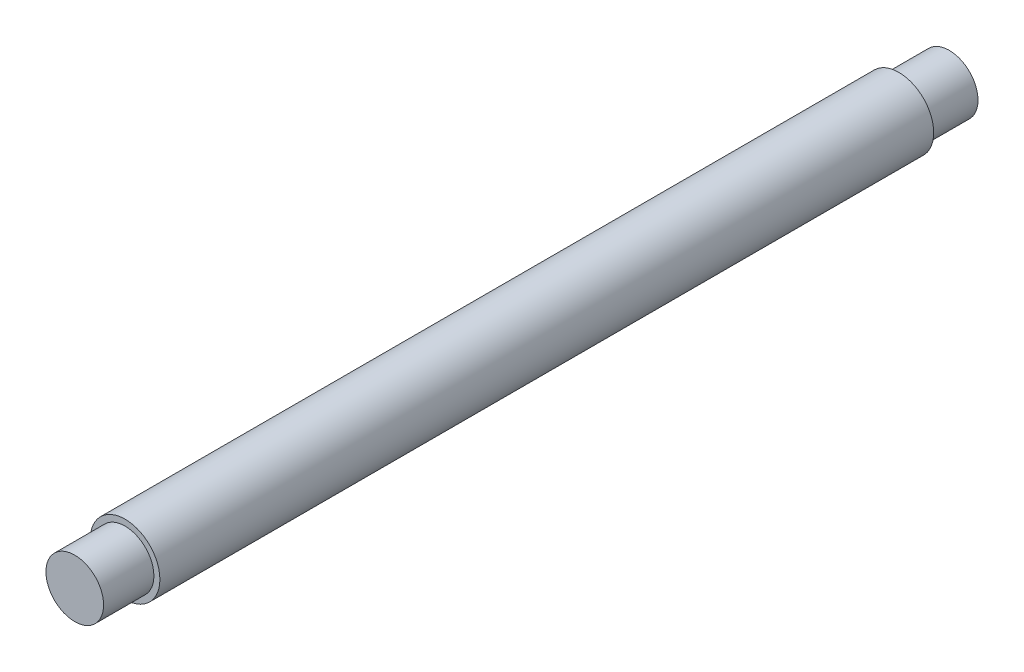
ISO-10303-21;
HEADER;
FILE_DESCRIPTION(('STEP AP214'),'2;1');
FILE_NAME('part.step','',(''),(''),'','','');
FILE_SCHEMA(('AUTOMOTIVE_DESIGN { 1 0 10303 214 1 1 1 1 }'));
ENDSEC;
DATA;
#1=APPLICATION_CONTEXT('core data for automotive mechanical design processes');
#2=APPLICATION_PROTOCOL_DEFINITION('international standard','automotive_design',2000,#1);
#3=PRODUCT_CONTEXT('',#1,'mechanical');
#4=PRODUCT('Part','Part','',(#3));
#5=PRODUCT_RELATED_PRODUCT_CATEGORY('part','',(#4));
#6=PRODUCT_DEFINITION_FORMATION('','',#4);
#7=PRODUCT_DEFINITION_CONTEXT('part definition',#1,'design');
#8=PRODUCT_DEFINITION('design','',#6,#7);
#9=PRODUCT_DEFINITION_SHAPE('','',#8);
#10=(LENGTH_UNIT() NAMED_UNIT(*) SI_UNIT(.MILLI.,.METRE.));
#11=(NAMED_UNIT(*) PLANE_ANGLE_UNIT() SI_UNIT($,.RADIAN.));
#12=(NAMED_UNIT(*) SI_UNIT($,.STERADIAN.) SOLID_ANGLE_UNIT());
#13=UNCERTAINTY_MEASURE_WITH_UNIT(LENGTH_MEASURE(1.E-05),#10,'distance_accuracy_value','');
#14=(GEOMETRIC_REPRESENTATION_CONTEXT(3) GLOBAL_UNCERTAINTY_ASSIGNED_CONTEXT((#13)) GLOBAL_UNIT_ASSIGNED_CONTEXT((#10,
#11,#12)) REPRESENTATION_CONTEXT('',''));
#15=CARTESIAN_POINT('',(0.,0.,0.));
#16=DIRECTION('',(0.,0.,1.));
#17=DIRECTION('',(1.,0.,0.));
#18=AXIS2_PLACEMENT_3D('',#15,#16,#17);
#19=CARTESIAN_POINT('',(0.,0.,26.));
#20=DIRECTION('',(0.,0.,-1.));
#21=DIRECTION('',(-1.,0.,0.));
#22=AXIS2_PLACEMENT_3D('',#19,#20,#21);
#23=CYLINDRICAL_SURFACE('',#22,14.9);
#24=CARTESIAN_POINT('',(0.,0.,26.));
#25=DIRECTION('',(0.,0.,1.));
#26=DIRECTION('',(1.,0.,0.));
#27=AXIS2_PLACEMENT_3D('',#24,#25,#26);
#28=CIRCLE('',#27,14.9);
#29=CARTESIAN_POINT('',(14.9,0.,26.));
#30=VERTEX_POINT('',#29);
#31=EDGE_CURVE('E10',#30,#30,#28,.T.);
#32=ORIENTED_EDGE('',*,*,#31,.F.);
#33=EDGE_LOOP('',(#32));
#34=FACE_BOUND('',#33,.T.);
#35=CARTESIAN_POINT('',(0.,0.,0.));
#36=DIRECTION('',(0.,0.,1.));
#37=DIRECTION('',(1.,0.,0.));
#38=AXIS2_PLACEMENT_3D('',#35,#36,#37);
#39=CIRCLE('',#38,14.9);
#40=CARTESIAN_POINT('',(14.9,0.,0.));
#41=VERTEX_POINT('',#40);
#42=EDGE_CURVE('E34',#41,#41,#39,.T.);
#43=ORIENTED_EDGE('',*,*,#42,.T.);
#44=EDGE_LOOP('',(#43));
#45=FACE_BOUND('',#44,.T.);
#46=ADVANCED_FACE('F31',(#34,#45),#23,.T.);
#47=CARTESIAN_POINT('',(0.,0.,0.));
#48=DIRECTION('',(0.,0.,1.));
#49=DIRECTION('',(1.,0.,0.));
#50=AXIS2_PLACEMENT_3D('',#47,#48,#49);
#51=PLANE('',#50);
#52=ORIENTED_EDGE('',*,*,#42,.F.);
#53=EDGE_LOOP('',(#52));
#54=FACE_BOUND('',#53,.T.);
#55=ADVANCED_FACE('F73',(#54),#51,.F.);
#56=CARTESIAN_POINT('',(0.,0.,426.));
#57=DIRECTION('',(0.,0.,-1.));
#58=DIRECTION('',(-1.,0.,0.));
#59=AXIS2_PLACEMENT_3D('',#56,#57,#58);
#60=CYLINDRICAL_SURFACE('',#59,18.);
#61=CARTESIAN_POINT('',(0.,0.,426.));
#62=DIRECTION('',(0.,0.,1.));
#63=DIRECTION('',(1.,0.,0.));
#64=AXIS2_PLACEMENT_3D('',#61,#62,#63);
#65=CIRCLE('',#64,18.);
#66=CARTESIAN_POINT('',(18.,0.,426.));
#67=VERTEX_POINT('',#66);
#68=EDGE_CURVE('E41',#67,#67,#65,.T.);
#69=ORIENTED_EDGE('',*,*,#68,.F.);
#70=EDGE_LOOP('',(#69));
#71=FACE_BOUND('',#70,.T.);
#72=CARTESIAN_POINT('',(0.,0.,26.));
#73=DIRECTION('',(0.,0.,1.));
#74=DIRECTION('',(1.,0.,0.));
#75=AXIS2_PLACEMENT_3D('',#72,#73,#74);
#76=CIRCLE('',#75,18.);
#77=CARTESIAN_POINT('',(18.,0.,26.));
#78=VERTEX_POINT('',#77);
#79=EDGE_CURVE('E43',#78,#78,#76,.T.);
#80=ORIENTED_EDGE('',*,*,#79,.T.);
#81=EDGE_LOOP('',(#80));
#82=FACE_BOUND('',#81,.T.);
#83=ADVANCED_FACE('F67',(#71,#82),#60,.T.);
#84=CARTESIAN_POINT('',(0.,0.,426.));
#85=DIRECTION('',(0.,0.,1.));
#86=DIRECTION('',(1.,0.,0.));
#87=AXIS2_PLACEMENT_3D('',#84,#85,#86);
#88=PLANE('',#87);
#89=CARTESIAN_POINT('',(0.,0.,426.));
#90=DIRECTION('',(0.,0.,1.));
#91=DIRECTION('',(1.,0.,0.));
#92=AXIS2_PLACEMENT_3D('',#89,#90,#91);
#93=CIRCLE('',#92,14.9);
#94=CARTESIAN_POINT('',(14.9,0.,426.));
#95=VERTEX_POINT('',#94);
#96=EDGE_CURVE('E49',#95,#95,#93,.T.);
#97=ORIENTED_EDGE('',*,*,#96,.F.);
#98=EDGE_LOOP('',(#97));
#99=FACE_BOUND('',#98,.T.);
#100=ORIENTED_EDGE('',*,*,#68,.T.);
#101=EDGE_LOOP('',(#100));
#102=FACE_BOUND('',#101,.T.);
#103=ADVANCED_FACE('F64',(#99,#102),#88,.T.);
#104=CARTESIAN_POINT('',(0.,0.,26.));
#105=DIRECTION('',(0.,0.,1.));
#106=DIRECTION('',(1.,0.,0.));
#107=AXIS2_PLACEMENT_3D('',#104,#105,#106);
#108=PLANE('',#107);
#109=ORIENTED_EDGE('',*,*,#31,.T.);
#110=EDGE_LOOP('',(#109));
#111=FACE_BOUND('',#110,.T.);
#112=ORIENTED_EDGE('',*,*,#79,.F.);
#113=EDGE_LOOP('',(#112));
#114=FACE_BOUND('',#113,.T.);
#115=ADVANCED_FACE('F60',(#111,#114),#108,.F.);
#116=CARTESIAN_POINT('',(0.,0.,452.));
#117=DIRECTION('',(0.,0.,-1.));
#118=DIRECTION('',(-1.,0.,0.));
#119=AXIS2_PLACEMENT_3D('',#116,#117,#118);
#120=CYLINDRICAL_SURFACE('',#119,14.9);
#121=CARTESIAN_POINT('',(0.,0.,452.));
#122=DIRECTION('',(0.,0.,1.));
#123=DIRECTION('',(1.,0.,0.));
#124=AXIS2_PLACEMENT_3D('',#121,#122,#123);
#125=CIRCLE('',#124,14.9);
#126=CARTESIAN_POINT('',(14.9,0.,452.));
#127=VERTEX_POINT('',#126);
#128=EDGE_CURVE('E46',#127,#127,#125,.T.);
#129=ORIENTED_EDGE('',*,*,#128,.F.);
#130=EDGE_LOOP('',(#129));
#131=FACE_BOUND('',#130,.T.);
#132=ORIENTED_EDGE('',*,*,#96,.T.);
#133=EDGE_LOOP('',(#132));
#134=FACE_BOUND('',#133,.T.);
#135=ADVANCED_FACE('F57',(#131,#134),#120,.T.);
#136=CARTESIAN_POINT('',(0.,0.,452.));
#137=DIRECTION('',(0.,0.,1.));
#138=DIRECTION('',(1.,0.,0.));
#139=AXIS2_PLACEMENT_3D('',#136,#137,#138);
#140=PLANE('',#139);
#141=ORIENTED_EDGE('',*,*,#128,.T.);
#142=EDGE_LOOP('',(#141));
#143=FACE_BOUND('',#142,.T.);
#144=ADVANCED_FACE('F55',(#143),#140,.T.);
#145=CLOSED_SHELL('',(#46,#55,#83,#103,#115,#135,#144));
#146=MANIFOLD_SOLID_BREP('B2',#145);
#147=ADVANCED_BREP_SHAPE_REPRESENTATION('',(#18,#146),#14);
#148=SHAPE_DEFINITION_REPRESENTATION(#9,#147);
ENDSEC;
END-ISO-10303-21;
